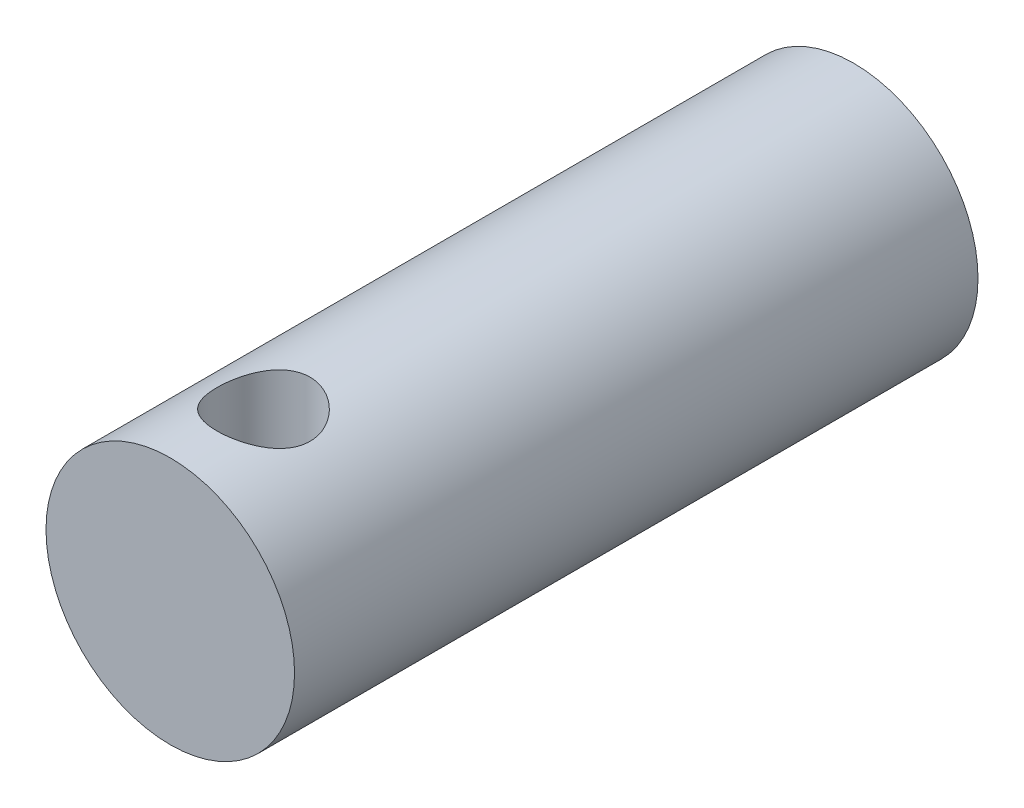
ISO-10303-21;
HEADER;
FILE_DESCRIPTION(('STEP AP214'),'2;1');
FILE_NAME('part.step','',(''),(''),'','','');
FILE_SCHEMA(('AUTOMOTIVE_DESIGN { 1 0 10303 214 1 1 1 1 }'));
ENDSEC;
DATA;
#1=APPLICATION_CONTEXT('core data for automotive mechanical design processes');
#2=APPLICATION_PROTOCOL_DEFINITION('international standard','automotive_design',2000,#1);
#3=PRODUCT_CONTEXT('',#1,'mechanical');
#4=PRODUCT('Part','Part','',(#3));
#5=PRODUCT_RELATED_PRODUCT_CATEGORY('part','',(#4));
#6=PRODUCT_DEFINITION_FORMATION('','',#4);
#7=PRODUCT_DEFINITION_CONTEXT('part definition',#1,'design');
#8=PRODUCT_DEFINITION('design','',#6,#7);
#9=PRODUCT_DEFINITION_SHAPE('','',#8);
#10=(LENGTH_UNIT() NAMED_UNIT(*) SI_UNIT(.MILLI.,.METRE.));
#11=(NAMED_UNIT(*) PLANE_ANGLE_UNIT() SI_UNIT($,.RADIAN.));
#12=(NAMED_UNIT(*) SI_UNIT($,.STERADIAN.) SOLID_ANGLE_UNIT());
#13=UNCERTAINTY_MEASURE_WITH_UNIT(LENGTH_MEASURE(1.E-05),#10,'distance_accuracy_value','');
#14=(GEOMETRIC_REPRESENTATION_CONTEXT(3) GLOBAL_UNCERTAINTY_ASSIGNED_CONTEXT((#13)) GLOBAL_UNIT_ASSIGNED_CONTEXT((#10,
#11,#12)) REPRESENTATION_CONTEXT('',''));
#15=CARTESIAN_POINT('',(0.,0.,0.));
#16=DIRECTION('',(0.,0.,1.));
#17=DIRECTION('',(1.,0.,0.));
#18=AXIS2_PLACEMENT_3D('',#15,#16,#17);
#19=CARTESIAN_POINT('',(0.,0.,22.));
#20=DIRECTION('',(0.,0.,-1.));
#21=DIRECTION('',(-1.,0.,0.));
#22=AXIS2_PLACEMENT_3D('',#19,#20,#21);
#23=CYLINDRICAL_SURFACE('',#22,4.);
#24=CARTESIAN_POINT('',(0.,-4.,20.5));
#25=CARTESIAN_POINT('',(0.081235058937853,-4.00000217456151,20.5000029023031));
#26=CARTESIAN_POINT('',(0.162450241781792,-3.99750379283184,20.4933802397516));
#27=CARTESIAN_POINT('',(0.322453452352361,-3.98778696006928,20.4671718047301));
#28=CARTESIAN_POINT('',(0.401241827987616,-3.98056918893993,20.4475878995294));
#29=CARTESIAN_POINT('',(0.554060784990879,-3.96218832391545,20.3962469982282));
#30=CARTESIAN_POINT('',(0.628100224162278,-3.9510328434944,20.3645134831782));
#31=CARTESIAN_POINT('',(0.769799310160254,-3.92588767765353,20.2898935869842));
#32=CARTESIAN_POINT('',(0.83745723917788,-3.91189723227548,20.2470042144558));
#33=CARTESIAN_POINT('',(0.967346417045827,-3.88186246971217,20.1493874689291));
#34=CARTESIAN_POINT('',(1.02927073015119,-3.86576002583566,20.0942697377406));
#35=CARTESIAN_POINT('',(1.14324421474363,-3.83360220871327,19.9745895653412));
#36=CARTESIAN_POINT('',(1.19529036359203,-3.81754685135033,19.9100242439121));
#37=CARTESIAN_POINT('',(1.28998202215985,-3.78662470617731,19.7702825324768));
#38=CARTESIAN_POINT('',(1.3321939319576,-3.77182648820818,19.6947956334542));
#39=CARTESIAN_POINT('',(1.40318646334085,-3.74599860237433,19.5371516458315));
#40=CARTESIAN_POINT('',(1.43197244961239,-3.73496742975881,19.4549972368449));
#41=CARTESIAN_POINT('',(1.47408431017549,-3.71854412824136,19.2898832597418));
#42=CARTESIAN_POINT('',(1.48799593218558,-3.71293924350838,19.2070949615646));
#43=CARTESIAN_POINT('',(1.50179556531648,-3.70738061461215,19.0401838420062));
#44=CARTESIAN_POINT('',(1.50168936802631,-3.70742453659305,18.9560615861255));
#45=CARTESIAN_POINT('',(1.48790429610018,-3.71297511632054,18.794230474787));
#46=CARTESIAN_POINT('',(1.47503808509004,-3.71815468871122,18.7164390939558));
#47=CARTESIAN_POINT('',(1.4374416786833,-3.73284938059529,18.5642128495947));
#48=CARTESIAN_POINT('',(1.41270969663258,-3.74236515298863,18.4897784933861));
#49=CARTESIAN_POINT('',(1.35163748571904,-3.76485702190253,18.3447229322718));
#50=CARTESIAN_POINT('',(1.31508648737101,-3.77789517988166,18.2742005138787));
#51=CARTESIAN_POINT('',(1.23156073762698,-3.80594210139319,18.140054262409));
#52=CARTESIAN_POINT('',(1.18458238728897,-3.82095154457158,18.0764328224803));
#53=CARTESIAN_POINT('',(1.07781780766549,-3.85248038859113,17.9533963363491));
#54=CARTESIAN_POINT('',(1.01738298716956,-3.86903347455671,17.8945513592519));
#55=CARTESIAN_POINT('',(0.887312590819021,-3.90091728164086,17.7876620337942));
#56=CARTESIAN_POINT('',(0.817675603497365,-3.91624781465952,17.7396193453943));
#57=CARTESIAN_POINT('',(0.669723436992421,-3.9442639480908,17.6550696029375));
#58=CARTESIAN_POINT('',(0.591290713844721,-3.95690498259616,17.6187524187789));
#59=CARTESIAN_POINT('',(0.428836850524584,-3.97778718326962,17.56001739573));
#60=CARTESIAN_POINT('',(0.344818210845767,-3.98603030341493,17.5375933834389));
#61=CARTESIAN_POINT('',(0.178375243148664,-3.99684443228065,17.5083772124581));
#62=CARTESIAN_POINT('',(0.0961036195622083,-3.99969369025686,17.5008173936175));
#63=CARTESIAN_POINT('',(-0.0685724752550253,-4.00025893700126,17.4993089361001));
#64=CARTESIAN_POINT('',(-0.150976912983374,-3.99797606386863,17.5053572796832));
#65=CARTESIAN_POINT('',(-0.31026204856186,-3.98871709772643,17.5303100423087));
#66=CARTESIAN_POINT('',(-0.387233328007337,-3.98192470962305,17.5487115437371));
#67=CARTESIAN_POINT('',(-0.536941754957222,-3.96451477091717,17.5971860725473));
#68=CARTESIAN_POINT('',(-0.609678350347535,-3.9538967228203,17.627260617948));
#69=CARTESIAN_POINT('',(-0.751247765110157,-3.92949624407681,17.6991864124395));
#70=CARTESIAN_POINT('',(-0.819903083557797,-3.91563000209348,17.7413577292234));
#71=CARTESIAN_POINT('',(-0.949392711726627,-3.88626671564664,17.8359181031716));
#72=CARTESIAN_POINT('',(-1.01022412027045,-3.87076907009516,17.8883109325452));
#73=CARTESIAN_POINT('',(-1.12603079874455,-3.83873329490989,18.0054041221243));
#74=CARTESIAN_POINT('',(-1.18046154123569,-3.82218696503729,18.0706421827727));
#75=CARTESIAN_POINT('',(-1.27771050031904,-3.79078815746854,18.2096513847077));
#76=CARTESIAN_POINT('',(-1.32052767414519,-3.77593583194399,18.2834232913885));
#77=CARTESIAN_POINT('',(-1.39337773518998,-3.74966829822463,18.4380159867723));
#78=CARTESIAN_POINT('',(-1.42335685446918,-3.73826760328493,18.5188647459104));
#79=CARTESIAN_POINT('',(-1.46907883466889,-3.72054032891005,18.6850097636878));
#80=CARTESIAN_POINT('',(-1.48483050305535,-3.71421061057491,18.7703032361981));
#81=CARTESIAN_POINT('',(-1.50086347097839,-3.70775894792573,18.9370161595411));
#82=CARTESIAN_POINT('',(-1.50207331495837,-3.70726444523341,19.0183326317169));
#83=CARTESIAN_POINT('',(-1.49136715641593,-3.71158412745292,19.1799453162762));
#84=CARTESIAN_POINT('',(-1.47945239850124,-3.71639780898899,19.2602416246716));
#85=CARTESIAN_POINT('',(-1.44355815630242,-3.73048141585432,19.4150472267166));
#86=CARTESIAN_POINT('',(-1.41995798316524,-3.73961085376663,19.4896583462453));
#87=CARTESIAN_POINT('',(-1.3616969677992,-3.76121548297845,19.6339055084944));
#88=CARTESIAN_POINT('',(-1.32703332944945,-3.77369151995215,19.7035402880701));
#89=CARTESIAN_POINT('',(-1.24552075938154,-3.80139723903965,19.8398267896976));
#90=CARTESIAN_POINT('',(-1.1981283280301,-3.81673698440964,19.9061307967999));
#91=CARTESIAN_POINT('',(-1.09334485729906,-3.84806246757177,20.0301415609712));
#92=CARTESIAN_POINT('',(-1.03595064012808,-3.86404840943145,20.0878455747868));
#93=CARTESIAN_POINT('',(-0.909080396784625,-3.89590424609881,20.1962019558218));
#94=CARTESIAN_POINT('',(-0.839118644212994,-3.91172104900644,20.2463037534347));
#95=CARTESIAN_POINT('',(-0.691213223200823,-3.9405451445703,20.3340226552766));
#96=CARTESIAN_POINT('',(-0.613268934090623,-3.95355221851559,20.3716387877364));
#97=CARTESIAN_POINT('',(-0.447999082002313,-3.9757429260668,20.4343768290483));
#98=CARTESIAN_POINT('',(-0.360413422234209,-3.98473657158356,20.4588870646019));
#99=CARTESIAN_POINT('',(-0.181875733606382,-3.99686242179587,20.4916929599207));
#100=CARTESIAN_POINT('',(-0.0909254163648589,-3.99999756603967,20.4999967514873));
#101=CARTESIAN_POINT('',(0.,-4.,20.5));
#102=B_SPLINE_CURVE_WITH_KNOTS('',3,(#24,#25,#26,#27,#28,#29,#30,#31,#32,#33,#34,#35,#36,#37,
#38,#39,#40,#41,#42,#43,#44,#45,#46,#47,#48,#49,#50,#51,#52,#53,#54,#55,#56,#57,#58,#59,#60,#61,
#62,#63,#64,#65,#66,#67,#68,#69,#70,#71,#72,#73,#74,#75,#76,#77,#78,#79,#80,#81,#82,#83,#84,#85,
#86,#87,#88,#89,#90,#91,#92,#93,#94,#95,#96,#97,#98,#99,#100,#101),.UNSPECIFIED.,.T.,.F.,(4,2,2,
2,2,2,2,2,2,2,2,2,2,2,2,2,2,2,2,2,2,2,2,2,2,2,2,2,2,2,2,2,2,2,2,2,2,2,4),(0.,0.24336980156056,
0.486704549530461,0.729571369213573,0.972503379609491,1.22473618582715,1.47704604925622,
1.73896674501659,2.00078269352134,2.25185874416902,2.50283106079707,2.73878345119972,
2.97477138060589,3.21522408387018,3.45575990744259,3.71246153335813,3.96920257905066,
4.22991375286075,4.49050899698846,4.73725019635926,4.98393668390521,5.2211443792384,
5.45838293254454,5.702592218596,5.94689180019868,6.20536519455659,6.46386178920142,
6.72343066727205,6.98283874956508,7.22558763480253,7.46831350211259,7.70363142426534,
7.93900886656507,8.18672471884272,8.43451941997063,8.69572329654039,8.95694749805103,
9.22948515032043,9.50188601796128),.UNSPECIFIED.);
#103=CARTESIAN_POINT('',(0.,-4.,20.5));
#104=VERTEX_POINT('',#103);
#105=EDGE_CURVE('E10',#104,#104,#102,.T.);
#106=ORIENTED_EDGE('',*,*,#105,.T.);
#107=EDGE_LOOP('',(#106));
#108=FACE_BOUND('',#107,.T.);
#109=CARTESIAN_POINT('',(0.,4.,20.5));
#110=CARTESIAN_POINT('',(-0.081235058937853,4.00000217456151,20.5000029023031));
#111=CARTESIAN_POINT('',(-0.162450241781792,3.99750379283184,20.4933802397516));
#112=CARTESIAN_POINT('',(-0.322453452352361,3.98778696006928,20.4671718047301));
#113=CARTESIAN_POINT('',(-0.401241827987616,3.98056918893993,20.4475878995294));
#114=CARTESIAN_POINT('',(-0.554060784990879,3.96218832391545,20.3962469982282));
#115=CARTESIAN_POINT('',(-0.628100224162278,3.9510328434944,20.3645134831782));
#116=CARTESIAN_POINT('',(-0.769799310160254,3.92588767765353,20.2898935869842));
#117=CARTESIAN_POINT('',(-0.83745723917788,3.91189723227548,20.2470042144558));
#118=CARTESIAN_POINT('',(-0.967346417045827,3.88186246971217,20.1493874689291));
#119=CARTESIAN_POINT('',(-1.02927073015119,3.86576002583566,20.0942697377406));
#120=CARTESIAN_POINT('',(-1.14324421474363,3.83360220871327,19.9745895653412));
#121=CARTESIAN_POINT('',(-1.19529036359203,3.81754685135033,19.9100242439121));
#122=CARTESIAN_POINT('',(-1.28998202215985,3.78662470617731,19.7702825324768));
#123=CARTESIAN_POINT('',(-1.3321939319576,3.77182648820818,19.6947956334542));
#124=CARTESIAN_POINT('',(-1.40318646334085,3.74599860237433,19.5371516458315));
#125=CARTESIAN_POINT('',(-1.43197244961239,3.73496742975881,19.4549972368449));
#126=CARTESIAN_POINT('',(-1.47408431017549,3.71854412824136,19.2898832597418));
#127=CARTESIAN_POINT('',(-1.48799593218558,3.71293924350838,19.2070949615646));
#128=CARTESIAN_POINT('',(-1.50179556531648,3.70738061461215,19.0401838420062));
#129=CARTESIAN_POINT('',(-1.50168936802631,3.70742453659305,18.9560615861255));
#130=CARTESIAN_POINT('',(-1.48790429610018,3.71297511632054,18.794230474787));
#131=CARTESIAN_POINT('',(-1.47503808509004,3.71815468871122,18.7164390939558));
#132=CARTESIAN_POINT('',(-1.4374416786833,3.73284938059529,18.5642128495947));
#133=CARTESIAN_POINT('',(-1.41270969663258,3.74236515298863,18.4897784933861));
#134=CARTESIAN_POINT('',(-1.35163748571904,3.76485702190253,18.3447229322718));
#135=CARTESIAN_POINT('',(-1.31508648737101,3.77789517988166,18.2742005138787));
#136=CARTESIAN_POINT('',(-1.23156073762698,3.80594210139319,18.140054262409));
#137=CARTESIAN_POINT('',(-1.18458238728897,3.82095154457158,18.0764328224803));
#138=CARTESIAN_POINT('',(-1.07781780766549,3.85248038859113,17.9533963363491));
#139=CARTESIAN_POINT('',(-1.01738298716956,3.86903347455671,17.8945513592519));
#140=CARTESIAN_POINT('',(-0.887312590819021,3.90091728164086,17.7876620337942));
#141=CARTESIAN_POINT('',(-0.817675603497365,3.91624781465952,17.7396193453943));
#142=CARTESIAN_POINT('',(-0.669723436992421,3.9442639480908,17.6550696029375));
#143=CARTESIAN_POINT('',(-0.591290713844721,3.95690498259616,17.6187524187789));
#144=CARTESIAN_POINT('',(-0.428836850524584,3.97778718326962,17.56001739573));
#145=CARTESIAN_POINT('',(-0.344818210845767,3.98603030341493,17.5375933834389));
#146=CARTESIAN_POINT('',(-0.178375243148664,3.99684443228065,17.5083772124581));
#147=CARTESIAN_POINT('',(-0.0961036195622083,3.99969369025686,17.5008173936175));
#148=CARTESIAN_POINT('',(0.0685724752550253,4.00025893700126,17.4993089361001));
#149=CARTESIAN_POINT('',(0.150976912983374,3.99797606386863,17.5053572796832));
#150=CARTESIAN_POINT('',(0.31026204856186,3.98871709772643,17.5303100423087));
#151=CARTESIAN_POINT('',(0.387233328007337,3.98192470962305,17.5487115437371));
#152=CARTESIAN_POINT('',(0.536941754957222,3.96451477091717,17.5971860725473));
#153=CARTESIAN_POINT('',(0.609678350347535,3.9538967228203,17.627260617948));
#154=CARTESIAN_POINT('',(0.751247765110157,3.92949624407681,17.6991864124395));
#155=CARTESIAN_POINT('',(0.819903083557797,3.91563000209348,17.7413577292234));
#156=CARTESIAN_POINT('',(0.949392711726627,3.88626671564664,17.8359181031716));
#157=CARTESIAN_POINT('',(1.01022412027045,3.87076907009516,17.8883109325452));
#158=CARTESIAN_POINT('',(1.12603079874455,3.83873329490989,18.0054041221243));
#159=CARTESIAN_POINT('',(1.18046154123569,3.82218696503729,18.0706421827727));
#160=CARTESIAN_POINT('',(1.27771050031904,3.79078815746854,18.2096513847077));
#161=CARTESIAN_POINT('',(1.32052767414519,3.77593583194399,18.2834232913885));
#162=CARTESIAN_POINT('',(1.39337773518998,3.74966829822463,18.4380159867723));
#163=CARTESIAN_POINT('',(1.42335685446918,3.73826760328493,18.5188647459104));
#164=CARTESIAN_POINT('',(1.46907883466889,3.72054032891005,18.6850097636878));
#165=CARTESIAN_POINT('',(1.48483050305535,3.71421061057491,18.7703032361981));
#166=CARTESIAN_POINT('',(1.50086347097839,3.70775894792573,18.9370161595411));
#167=CARTESIAN_POINT('',(1.50207331495837,3.70726444523341,19.0183326317169));
#168=CARTESIAN_POINT('',(1.49136715641593,3.71158412745292,19.1799453162762));
#169=CARTESIAN_POINT('',(1.47945239850124,3.71639780898899,19.2602416246716));
#170=CARTESIAN_POINT('',(1.44355815630242,3.73048141585432,19.4150472267166));
#171=CARTESIAN_POINT('',(1.41995798316524,3.73961085376663,19.4896583462453));
#172=CARTESIAN_POINT('',(1.3616969677992,3.76121548297845,19.6339055084944));
#173=CARTESIAN_POINT('',(1.32703332944945,3.77369151995215,19.7035402880701));
#174=CARTESIAN_POINT('',(1.24552075938154,3.80139723903965,19.8398267896976));
#175=CARTESIAN_POINT('',(1.1981283280301,3.81673698440964,19.9061307967999));
#176=CARTESIAN_POINT('',(1.09334485729906,3.84806246757177,20.0301415609712));
#177=CARTESIAN_POINT('',(1.03595064012808,3.86404840943145,20.0878455747868));
#178=CARTESIAN_POINT('',(0.909080396784625,3.89590424609881,20.1962019558218));
#179=CARTESIAN_POINT('',(0.839118644212994,3.91172104900644,20.2463037534347));
#180=CARTESIAN_POINT('',(0.691213223200823,3.9405451445703,20.3340226552766));
#181=CARTESIAN_POINT('',(0.613268934090623,3.95355221851559,20.3716387877364));
#182=CARTESIAN_POINT('',(0.447999082002313,3.9757429260668,20.4343768290483));
#183=CARTESIAN_POINT('',(0.360413422234209,3.98473657158356,20.4588870646019));
#184=CARTESIAN_POINT('',(0.181875733606382,3.99686242179587,20.4916929599207));
#185=CARTESIAN_POINT('',(0.0909254163648589,3.99999756603967,20.4999967514873));
#186=CARTESIAN_POINT('',(0.,4.,20.5));
#187=B_SPLINE_CURVE_WITH_KNOTS('',3,(#109,#110,#111,#112,#113,#114,#115,#116,#117,#118,#119,
#120,#121,#122,#123,#124,#125,#126,#127,#128,#129,#130,#131,#132,#133,#134,#135,#136,#137,#138,
#139,#140,#141,#142,#143,#144,#145,#146,#147,#148,#149,#150,#151,#152,#153,#154,#155,#156,#157,
#158,#159,#160,#161,#162,#163,#164,#165,#166,#167,#168,#169,#170,#171,#172,#173,#174,#175,#176,
#177,#178,#179,#180,#181,#182,#183,#184,#185,#186),.UNSPECIFIED.,.T.,.F.,(4,2,2,2,2,2,2,2,2,2,2,
2,2,2,2,2,2,2,2,2,2,2,2,2,2,2,2,2,2,2,2,2,2,2,2,2,2,2,4),(0.,0.24336980156056,0.486704549530461,
0.729571369213573,0.972503379609491,1.22473618582715,1.47704604925622,1.73896674501659,
2.00078269352134,2.25185874416902,2.50283106079707,2.73878345119972,2.97477138060589,
3.21522408387018,3.45575990744259,3.71246153335813,3.96920257905066,4.22991375286075,
4.49050899698846,4.73725019635926,4.98393668390521,5.2211443792384,5.45838293254454,
5.702592218596,5.94689180019868,6.20536519455659,6.46386178920142,6.72343066727205,
6.98283874956508,7.22558763480253,7.46831350211259,7.70363142426534,7.93900886656507,
8.18672471884272,8.43451941997063,8.69572329654039,8.95694749805103,9.22948515032043,
9.50188601796128),.UNSPECIFIED.);
#188=CARTESIAN_POINT('',(0.,4.,20.5));
#189=VERTEX_POINT('',#188);
#190=EDGE_CURVE('E54',#189,#189,#187,.T.);
#191=ORIENTED_EDGE('',*,*,#190,.T.);
#192=EDGE_LOOP('',(#191));
#193=FACE_BOUND('',#192,.T.);
#194=CARTESIAN_POINT('',(0.,0.,22.));
#195=DIRECTION('',(0.,0.,1.));
#196=DIRECTION('',(1.,0.,0.));
#197=AXIS2_PLACEMENT_3D('',#194,#195,#196);
#198=CIRCLE('',#197,4.);
#199=CARTESIAN_POINT('',(4.,0.,22.));
#200=VERTEX_POINT('',#199);
#201=EDGE_CURVE('E59',#200,#200,#198,.T.);
#202=ORIENTED_EDGE('',*,*,#201,.F.);
#203=EDGE_LOOP('',(#202));
#204=FACE_BOUND('',#203,.T.);
#205=CARTESIAN_POINT('',(0.,0.,0.));
#206=DIRECTION('',(0.,0.,1.));
#207=DIRECTION('',(1.,0.,0.));
#208=AXIS2_PLACEMENT_3D('',#205,#206,#207);
#209=CIRCLE('',#208,4.);
#210=CARTESIAN_POINT('',(4.,0.,0.));
#211=VERTEX_POINT('',#210);
#212=EDGE_CURVE('E64',#211,#211,#209,.T.);
#213=ORIENTED_EDGE('',*,*,#212,.T.);
#214=EDGE_LOOP('',(#213));
#215=FACE_BOUND('',#214,.T.);
#216=ADVANCED_FACE('F42',(#108,#193,#204,#215),#23,.T.);
#217=CARTESIAN_POINT('',(0.,0.,22.));
#218=DIRECTION('',(0.,0.,1.));
#219=DIRECTION('',(1.,0.,0.));
#220=AXIS2_PLACEMENT_3D('',#217,#218,#219);
#221=PLANE('',#220);
#222=ORIENTED_EDGE('',*,*,#201,.T.);
#223=EDGE_LOOP('',(#222));
#224=FACE_BOUND('',#223,.T.);
#225=ADVANCED_FACE('F76',(#224),#221,.T.);
#226=CARTESIAN_POINT('',(0.,0.,0.));
#227=DIRECTION('',(0.,0.,1.));
#228=DIRECTION('',(1.,0.,0.));
#229=AXIS2_PLACEMENT_3D('',#226,#227,#228);
#230=PLANE('',#229);
#231=ORIENTED_EDGE('',*,*,#212,.F.);
#232=EDGE_LOOP('',(#231));
#233=FACE_BOUND('',#232,.T.);
#234=ADVANCED_FACE('F74',(#233),#230,.F.);
#235=CARTESIAN_POINT('',(0.,-4.,19.));
#236=DIRECTION('',(0.,1.,0.));
#237=DIRECTION('',(0.,0.,1.));
#238=AXIS2_PLACEMENT_3D('',#235,#236,#237);
#239=CYLINDRICAL_SURFACE('',#238,1.5);
#240=ORIENTED_EDGE('',*,*,#190,.F.);
#241=EDGE_LOOP('',(#240));
#242=FACE_BOUND('',#241,.T.);
#243=ORIENTED_EDGE('',*,*,#105,.F.);
#244=EDGE_LOOP('',(#243));
#245=FACE_BOUND('',#244,.T.);
#246=ADVANCED_FACE('F70',(#242,#245),#239,.F.);
#247=CLOSED_SHELL('',(#216,#225,#234,#246));
#248=MANIFOLD_SOLID_BREP('B2',#247);
#249=ADVANCED_BREP_SHAPE_REPRESENTATION('',(#18,#248),#14);
#250=SHAPE_DEFINITION_REPRESENTATION(#9,#249);
ENDSEC;
END-ISO-10303-21;
